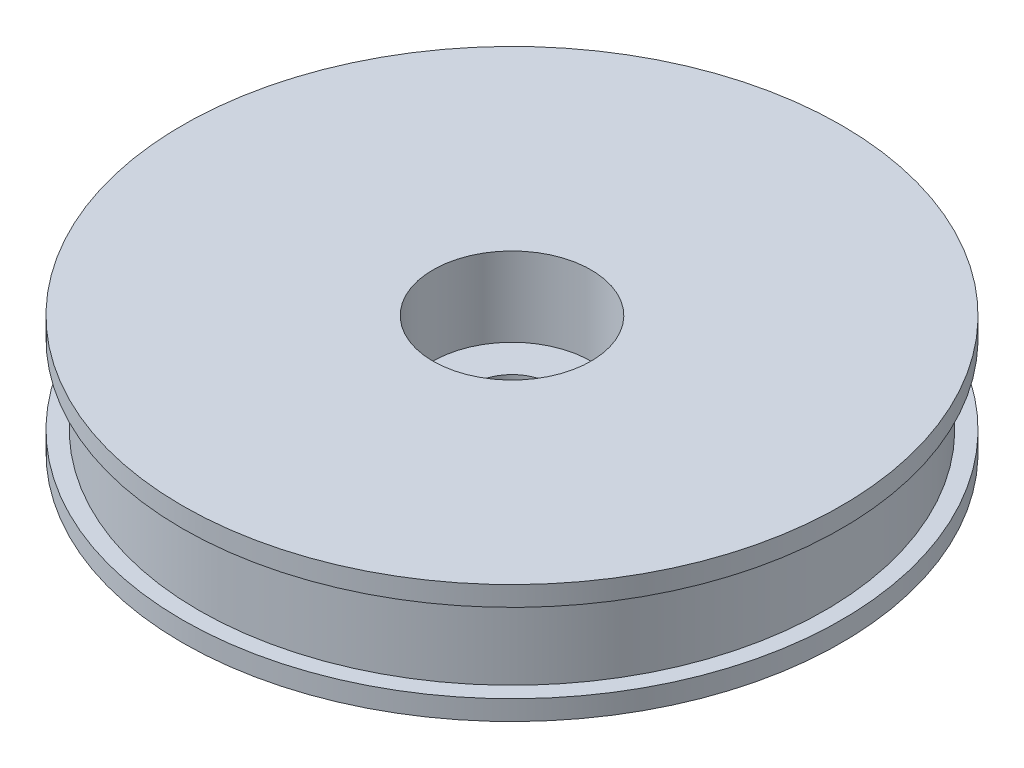
ISO-10303-21;
HEADER;
FILE_DESCRIPTION(('STEP AP214'),'2;1');
FILE_NAME('part.step','',(''),(''),'','','');
FILE_SCHEMA(('AUTOMOTIVE_DESIGN { 1 0 10303 214 1 1 1 1 }'));
ENDSEC;
DATA;
#1=APPLICATION_CONTEXT('core data for automotive mechanical design processes');
#2=APPLICATION_PROTOCOL_DEFINITION('international standard','automotive_design',2000,#1);
#3=PRODUCT_CONTEXT('',#1,'mechanical');
#4=PRODUCT('Part','Part','',(#3));
#5=PRODUCT_RELATED_PRODUCT_CATEGORY('part','',(#4));
#6=PRODUCT_DEFINITION_FORMATION('','',#4);
#7=PRODUCT_DEFINITION_CONTEXT('part definition',#1,'design');
#8=PRODUCT_DEFINITION('design','',#6,#7);
#9=PRODUCT_DEFINITION_SHAPE('','',#8);
#10=(LENGTH_UNIT() NAMED_UNIT(*) SI_UNIT(.MILLI.,.METRE.));
#11=(NAMED_UNIT(*) PLANE_ANGLE_UNIT() SI_UNIT($,.RADIAN.));
#12=(NAMED_UNIT(*) SI_UNIT($,.STERADIAN.) SOLID_ANGLE_UNIT());
#13=UNCERTAINTY_MEASURE_WITH_UNIT(LENGTH_MEASURE(1.E-05),#10,'distance_accuracy_value','');
#14=(GEOMETRIC_REPRESENTATION_CONTEXT(3) GLOBAL_UNCERTAINTY_ASSIGNED_CONTEXT((#13)) GLOBAL_UNIT_ASSIGNED_CONTEXT((#10,
#11,#12)) REPRESENTATION_CONTEXT('',''));
#15=CARTESIAN_POINT('',(0.,0.,0.));
#16=DIRECTION('',(0.,0.,1.));
#17=DIRECTION('',(1.,0.,0.));
#18=AXIS2_PLACEMENT_3D('',#15,#16,#17);
#19=CARTESIAN_POINT('',(0.,0.762,0.));
#20=DIRECTION('',(0.,-1.,0.));
#21=DIRECTION('',(0.,0.,-1.));
#22=AXIS2_PLACEMENT_3D('',#19,#20,#21);
#23=CYLINDRICAL_SURFACE('',#22,12.7);
#24=CARTESIAN_POINT('',(0.,0.762,0.));
#25=DIRECTION('',(0.,1.,0.));
#26=DIRECTION('',(0.,0.,1.));
#27=AXIS2_PLACEMENT_3D('',#24,#25,#26);
#28=CIRCLE('',#27,12.7);
#29=CARTESIAN_POINT('',(0.,0.762,12.7));
#30=VERTEX_POINT('',#29);
#31=EDGE_CURVE('E45',#30,#30,#28,.T.);
#32=ORIENTED_EDGE('',*,*,#31,.F.);
#33=EDGE_LOOP('',(#32));
#34=FACE_BOUND('',#33,.T.);
#35=CARTESIAN_POINT('',(0.,0.,0.));
#36=DIRECTION('',(0.,1.,0.));
#37=DIRECTION('',(0.,0.,1.));
#38=AXIS2_PLACEMENT_3D('',#35,#36,#37);
#39=CIRCLE('',#38,12.7);
#40=CARTESIAN_POINT('',(0.,0.,12.7));
#41=VERTEX_POINT('',#40);
#42=EDGE_CURVE('E40',#41,#41,#39,.T.);
#43=ORIENTED_EDGE('',*,*,#42,.T.);
#44=EDGE_LOOP('',(#43));
#45=FACE_BOUND('',#44,.T.);
#46=ADVANCED_FACE('F37',(#34,#45),#23,.T.);
#47=CARTESIAN_POINT('',(0.,0.762,0.));
#48=DIRECTION('',(0.,1.,0.));
#49=DIRECTION('',(0.,0.,1.));
#50=AXIS2_PLACEMENT_3D('',#47,#48,#49);
#51=PLANE('',#50);
#52=CARTESIAN_POINT('',(0.,0.762,0.));
#53=DIRECTION('',(0.,1.,0.));
#54=DIRECTION('',(0.,0.,1.));
#55=AXIS2_PLACEMENT_3D('',#52,#53,#54);
#56=CIRCLE('',#55,12.065);
#57=CARTESIAN_POINT('',(0.,0.762,12.065));
#58=VERTEX_POINT('',#57);
#59=EDGE_CURVE('E10',#58,#58,#56,.T.);
#60=ORIENTED_EDGE('',*,*,#59,.F.);
#61=EDGE_LOOP('',(#60));
#62=FACE_BOUND('',#61,.T.);
#63=ORIENTED_EDGE('',*,*,#31,.T.);
#64=EDGE_LOOP('',(#63));
#65=FACE_BOUND('',#64,.T.);
#66=ADVANCED_FACE('F122',(#62,#65),#51,.T.);
#67=CARTESIAN_POINT('',(0.,0.,0.));
#68=DIRECTION('',(0.,1.,0.));
#69=DIRECTION('',(0.,0.,1.));
#70=AXIS2_PLACEMENT_3D('',#67,#68,#69);
#71=PLANE('',#70);
#72=CARTESIAN_POINT('',(0.,0.,0.));
#73=DIRECTION('',(0.,1.,0.));
#74=DIRECTION('',(0.,0.,1.));
#75=AXIS2_PLACEMENT_3D('',#72,#73,#74);
#76=CIRCLE('',#75,1.524);
#77=CARTESIAN_POINT('',(0.,0.,1.524));
#78=VERTEX_POINT('',#77);
#79=EDGE_CURVE('E69',#78,#78,#76,.T.);
#80=ORIENTED_EDGE('',*,*,#79,.T.);
#81=EDGE_LOOP('',(#80));
#82=FACE_BOUND('',#81,.T.);
#83=ORIENTED_EDGE('',*,*,#42,.F.);
#84=EDGE_LOOP('',(#83));
#85=FACE_BOUND('',#84,.T.);
#86=ADVANCED_FACE('F81',(#82,#85),#71,.F.);
#87=CARTESIAN_POINT('',(0.,3.81,0.));
#88=DIRECTION('',(0.,-1.,0.));
#89=DIRECTION('',(0.,0.,-1.));
#90=AXIS2_PLACEMENT_3D('',#87,#88,#89);
#91=CYLINDRICAL_SURFACE('',#90,12.065);
#92=CARTESIAN_POINT('',(0.,3.81,0.));
#93=DIRECTION('',(0.,1.,0.));
#94=DIRECTION('',(0.,0.,1.));
#95=AXIS2_PLACEMENT_3D('',#92,#93,#94);
#96=CIRCLE('',#95,12.065);
#97=CARTESIAN_POINT('',(0.,3.81,12.065));
#98=VERTEX_POINT('',#97);
#99=EDGE_CURVE('E52',#98,#98,#96,.T.);
#100=ORIENTED_EDGE('',*,*,#99,.F.);
#101=EDGE_LOOP('',(#100));
#102=FACE_BOUND('',#101,.T.);
#103=ORIENTED_EDGE('',*,*,#59,.T.);
#104=EDGE_LOOP('',(#103));
#105=FACE_BOUND('',#104,.T.);
#106=ADVANCED_FACE('F112',(#102,#105),#91,.T.);
#107=CARTESIAN_POINT('',(0.,4.572,0.));
#108=DIRECTION('',(0.,-1.,0.));
#109=DIRECTION('',(0.,0.,-1.));
#110=AXIS2_PLACEMENT_3D('',#107,#108,#109);
#111=CYLINDRICAL_SURFACE('',#110,12.7);
#112=CARTESIAN_POINT('',(0.,4.572,0.));
#113=DIRECTION('',(0.,1.,0.));
#114=DIRECTION('',(0.,0.,1.));
#115=AXIS2_PLACEMENT_3D('',#112,#113,#114);
#116=CIRCLE('',#115,12.7);
#117=CARTESIAN_POINT('',(0.,4.572,12.7));
#118=VERTEX_POINT('',#117);
#119=EDGE_CURVE('E56',#118,#118,#116,.T.);
#120=ORIENTED_EDGE('',*,*,#119,.F.);
#121=EDGE_LOOP('',(#120));
#122=FACE_BOUND('',#121,.T.);
#123=CARTESIAN_POINT('',(0.,3.81,0.));
#124=DIRECTION('',(0.,1.,0.));
#125=DIRECTION('',(0.,0.,1.));
#126=AXIS2_PLACEMENT_3D('',#123,#124,#125);
#127=CIRCLE('',#126,12.7);
#128=CARTESIAN_POINT('',(0.,3.81,12.7));
#129=VERTEX_POINT('',#128);
#130=EDGE_CURVE('E57',#129,#129,#127,.T.);
#131=ORIENTED_EDGE('',*,*,#130,.T.);
#132=EDGE_LOOP('',(#131));
#133=FACE_BOUND('',#132,.T.);
#134=ADVANCED_FACE('F106',(#122,#133),#111,.T.);
#135=CARTESIAN_POINT('',(0.,4.572,0.));
#136=DIRECTION('',(0.,1.,0.));
#137=DIRECTION('',(0.,0.,1.));
#138=AXIS2_PLACEMENT_3D('',#135,#136,#137);
#139=PLANE('',#138);
#140=CARTESIAN_POINT('',(0.,4.572,0.));
#141=DIRECTION('',(0.,1.,0.));
#142=DIRECTION('',(0.,0.,1.));
#143=AXIS2_PLACEMENT_3D('',#140,#141,#142);
#144=CIRCLE('',#143,3.048);
#145=CARTESIAN_POINT('',(0.,4.572,3.048));
#146=VERTEX_POINT('',#145);
#147=EDGE_CURVE('E65',#146,#146,#144,.T.);
#148=ORIENTED_EDGE('',*,*,#147,.F.);
#149=EDGE_LOOP('',(#148));
#150=FACE_BOUND('',#149,.T.);
#151=ORIENTED_EDGE('',*,*,#119,.T.);
#152=EDGE_LOOP('',(#151));
#153=FACE_BOUND('',#152,.T.);
#154=ADVANCED_FACE('F103',(#150,#153),#139,.T.);
#155=CARTESIAN_POINT('',(0.,3.81,0.));
#156=DIRECTION('',(0.,1.,0.));
#157=DIRECTION('',(0.,0.,1.));
#158=AXIS2_PLACEMENT_3D('',#155,#156,#157);
#159=PLANE('',#158);
#160=ORIENTED_EDGE('',*,*,#99,.T.);
#161=EDGE_LOOP('',(#160));
#162=FACE_BOUND('',#161,.T.);
#163=ORIENTED_EDGE('',*,*,#130,.F.);
#164=EDGE_LOOP('',(#163));
#165=FACE_BOUND('',#164,.T.);
#166=ADVANCED_FACE('F99',(#162,#165),#159,.F.);
#167=CARTESIAN_POINT('',(0.,1.524,0.));
#168=DIRECTION('',(0.,1.,0.));
#169=DIRECTION('',(0.,0.,1.));
#170=AXIS2_PLACEMENT_3D('',#167,#168,#169);
#171=CYLINDRICAL_SURFACE('',#170,3.048);
#172=CARTESIAN_POINT('',(0.,1.524,0.));
#173=DIRECTION('',(0.,1.,0.));
#174=DIRECTION('',(0.,0.,1.));
#175=AXIS2_PLACEMENT_3D('',#172,#173,#174);
#176=CIRCLE('',#175,3.048);
#177=CARTESIAN_POINT('',(0.,1.524,3.048));
#178=VERTEX_POINT('',#177);
#179=EDGE_CURVE('E61',#178,#178,#176,.T.);
#180=ORIENTED_EDGE('',*,*,#179,.F.);
#181=EDGE_LOOP('',(#180));
#182=FACE_BOUND('',#181,.T.);
#183=ORIENTED_EDGE('',*,*,#147,.T.);
#184=EDGE_LOOP('',(#183));
#185=FACE_BOUND('',#184,.T.);
#186=ADVANCED_FACE('F93',(#182,#185),#171,.F.);
#187=CARTESIAN_POINT('',(0.,1.524,0.));
#188=DIRECTION('',(0.,1.,0.));
#189=DIRECTION('',(0.,0.,1.));
#190=AXIS2_PLACEMENT_3D('',#187,#188,#189);
#191=PLANE('',#190);
#192=CARTESIAN_POINT('',(0.,1.524,0.));
#193=DIRECTION('',(0.,1.,0.));
#194=DIRECTION('',(0.,0.,1.));
#195=AXIS2_PLACEMENT_3D('',#192,#193,#194);
#196=CIRCLE('',#195,1.524);
#197=CARTESIAN_POINT('',(0.,1.524,1.524));
#198=VERTEX_POINT('',#197);
#199=EDGE_CURVE('E73',#198,#198,#196,.T.);
#200=ORIENTED_EDGE('',*,*,#199,.F.);
#201=EDGE_LOOP('',(#200));
#202=FACE_BOUND('',#201,.T.);
#203=ORIENTED_EDGE('',*,*,#179,.T.);
#204=EDGE_LOOP('',(#203));
#205=FACE_BOUND('',#204,.T.);
#206=ADVANCED_FACE('F87',(#202,#205),#191,.T.);
#207=CARTESIAN_POINT('',(0.,0.,0.));
#208=DIRECTION('',(0.,1.,0.));
#209=DIRECTION('',(0.,0.,1.));
#210=AXIS2_PLACEMENT_3D('',#207,#208,#209);
#211=CYLINDRICAL_SURFACE('',#210,1.524);
#212=ORIENTED_EDGE('',*,*,#79,.F.);
#213=EDGE_LOOP('',(#212));
#214=FACE_BOUND('',#213,.T.);
#215=ORIENTED_EDGE('',*,*,#199,.T.);
#216=EDGE_LOOP('',(#215));
#217=FACE_BOUND('',#216,.T.);
#218=ADVANCED_FACE('F84',(#214,#217),#211,.F.);
#219=CLOSED_SHELL('',(#46,#66,#86,#106,#134,#154,#166,#186,#206,#218));
#220=MANIFOLD_SOLID_BREP('B2',#219);
#221=ADVANCED_BREP_SHAPE_REPRESENTATION('',(#18,#220),#14);
#222=SHAPE_DEFINITION_REPRESENTATION(#9,#221);
ENDSEC;
END-ISO-10303-21;
